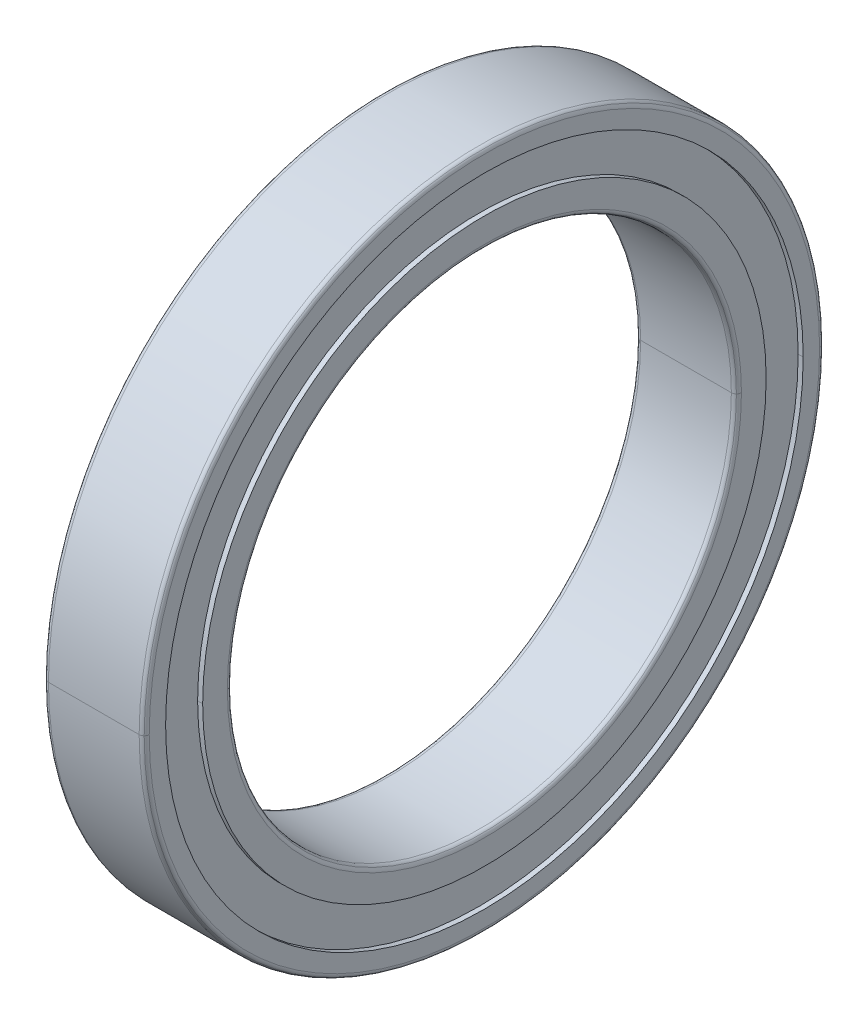
ISO-10303-21;
HEADER;
FILE_DESCRIPTION(('STEP AP214'),'2;1');
FILE_NAME('part.step','',(''),(''),'','','');
FILE_SCHEMA(('AUTOMOTIVE_DESIGN { 1 0 10303 214 1 1 1 1 }'));
ENDSEC;
DATA;
#1=APPLICATION_CONTEXT('core data for automotive mechanical design processes');
#2=APPLICATION_PROTOCOL_DEFINITION('international standard','automotive_design',2000,#1);
#3=PRODUCT_CONTEXT('',#1,'mechanical');
#4=PRODUCT('Part','Part','',(#3));
#5=PRODUCT_RELATED_PRODUCT_CATEGORY('part','',(#4));
#6=PRODUCT_DEFINITION_FORMATION('','',#4);
#7=PRODUCT_DEFINITION_CONTEXT('part definition',#1,'design');
#8=PRODUCT_DEFINITION('design','',#6,#7);
#9=PRODUCT_DEFINITION_SHAPE('','',#8);
#10=(LENGTH_UNIT() NAMED_UNIT(*) SI_UNIT(.MILLI.,.METRE.));
#11=(NAMED_UNIT(*) PLANE_ANGLE_UNIT() SI_UNIT($,.RADIAN.));
#12=(NAMED_UNIT(*) SI_UNIT($,.STERADIAN.) SOLID_ANGLE_UNIT());
#13=UNCERTAINTY_MEASURE_WITH_UNIT(LENGTH_MEASURE(1.E-05),#10,'distance_accuracy_value','');
#14=(GEOMETRIC_REPRESENTATION_CONTEXT(3) GLOBAL_UNCERTAINTY_ASSIGNED_CONTEXT((#13)) GLOBAL_UNIT_ASSIGNED_CONTEXT((#10,
#11,#12)) REPRESENTATION_CONTEXT('',''));
#15=CARTESIAN_POINT('',(0.,0.,0.));
#16=DIRECTION('',(0.,0.,1.));
#17=DIRECTION('',(1.,0.,0.));
#18=AXIS2_PLACEMENT_3D('',#15,#16,#17);
#19=CARTESIAN_POINT('',(3.8,0.,0.));
#20=DIRECTION('',(1.,0.,0.));
#21=DIRECTION('',(0.,0.,-1.));
#22=AXIS2_PLACEMENT_3D('',#19,#20,#21);
#23=TOROIDAL_SURFACE('',#22,10.2,0.2);
#24=CARTESIAN_POINT('',(3.8,0.,-10.2));
#25=DIRECTION('',(0.,-1.,0.));
#26=DIRECTION('',(1.,0.,0.));
#27=AXIS2_PLACEMENT_3D('',#24,#25,#26);
#28=CIRCLE('',#27,0.2);
#29=CARTESIAN_POINT('',(4.,0.,-10.2));
#30=VERTEX_POINT('',#29);
#31=CARTESIAN_POINT('',(3.941421356237,0.,-10.05857864376));
#32=VERTEX_POINT('',#31);
#33=EDGE_CURVE('E11',#30,#32,#28,.T.);
#34=ORIENTED_EDGE('',*,*,#33,.T.);
#35=CARTESIAN_POINT('',(3.941421356237,0.,0.));
#36=DIRECTION('',(1.,0.,0.));
#37=DIRECTION('',(0.,0.,1.));
#38=AXIS2_PLACEMENT_3D('',#35,#36,#37);
#39=CIRCLE('',#38,10.05857864376);
#40=CARTESIAN_POINT('',(3.941421356237,0.,10.05857864376));
#41=VERTEX_POINT('',#40);
#42=EDGE_CURVE('E43',#41,#32,#39,.T.);
#43=ORIENTED_EDGE('',*,*,#42,.F.);
#44=CARTESIAN_POINT('',(3.8,0.,10.2));
#45=DIRECTION('',(0.,1.,0.));
#46=DIRECTION('',(1.,0.,0.));
#47=AXIS2_PLACEMENT_3D('',#44,#45,#46);
#48=CIRCLE('',#47,0.2);
#49=CARTESIAN_POINT('',(4.,0.,10.2));
#50=VERTEX_POINT('',#49);
#51=EDGE_CURVE('E260',#50,#41,#48,.T.);
#52=ORIENTED_EDGE('',*,*,#51,.F.);
#53=CARTESIAN_POINT('',(4.,0.,0.));
#54=DIRECTION('',(-1.,0.,0.));
#55=DIRECTION('',(0.,0.,-1.));
#56=AXIS2_PLACEMENT_3D('',#53,#54,#55);
#57=CIRCLE('',#56,10.2);
#58=EDGE_CURVE('E255',#30,#50,#57,.T.);
#59=ORIENTED_EDGE('',*,*,#58,.F.);
#60=EDGE_LOOP('',(#34,#43,#52,#59));
#61=FACE_BOUND('',#60,.T.);
#62=ADVANCED_FACE('F17',(#61),#23,.T.);
#63=CARTESIAN_POINT('',(4.,0.,0.));
#64=DIRECTION('',(1.,0.,0.));
#65=DIRECTION('',(0.,0.,-1.));
#66=AXIS2_PLACEMENT_3D('',#63,#64,#65);
#67=CYLINDRICAL_SURFACE('',#66,11.18);
#68=DIRECTION('',(1.,0.,0.));
#69=VECTOR('',#68,1.);
#70=CARTESIAN_POINT('',(3.8,0.,-11.18));
#71=LINE('',#70,#69);
#72=CARTESIAN_POINT('',(3.8,0.,-11.18));
#73=VERTEX_POINT('',#72);
#74=CARTESIAN_POINT('',(4.,0.,-11.18));
#75=VERTEX_POINT('',#74);
#76=EDGE_CURVE('E28',#73,#75,#71,.T.);
#77=ORIENTED_EDGE('',*,*,#76,.T.);
#78=CARTESIAN_POINT('',(4.,0.,0.));
#79=DIRECTION('',(1.,0.,0.));
#80=DIRECTION('',(0.,0.,1.));
#81=AXIS2_PLACEMENT_3D('',#78,#79,#80);
#82=CIRCLE('',#81,11.18);
#83=CARTESIAN_POINT('',(4.,0.,11.18));
#84=VERTEX_POINT('',#83);
#85=EDGE_CURVE('E402',#84,#75,#82,.T.);
#86=ORIENTED_EDGE('',*,*,#85,.F.);
#87=DIRECTION('',(1.,0.,0.));
#88=VECTOR('',#87,1.);
#89=CARTESIAN_POINT('',(3.8,0.,11.18));
#90=LINE('',#89,#88);
#91=CARTESIAN_POINT('',(3.8,0.,11.18));
#92=VERTEX_POINT('',#91);
#93=EDGE_CURVE('E323',#92,#84,#90,.T.);
#94=ORIENTED_EDGE('',*,*,#93,.F.);
#95=CARTESIAN_POINT('',(3.8,0.,0.));
#96=DIRECTION('',(-1.,0.,0.));
#97=DIRECTION('',(0.,0.,-1.));
#98=AXIS2_PLACEMENT_3D('',#95,#96,#97);
#99=CIRCLE('',#98,11.18);
#100=EDGE_CURVE('E304',#73,#92,#99,.T.);
#101=ORIENTED_EDGE('',*,*,#100,.F.);
#102=EDGE_LOOP('',(#77,#86,#94,#101));
#103=FACE_BOUND('',#102,.T.);
#104=ADVANCED_FACE('F499',(#103),#67,.T.);
#105=CARTESIAN_POINT('',(4.,0.,0.));
#106=DIRECTION('',(1.,0.,0.));
#107=DIRECTION('',(0.,0.,-1.));
#108=AXIS2_PLACEMENT_3D('',#105,#106,#107);
#109=CYLINDRICAL_SURFACE('',#108,12.65);
#110=DIRECTION('',(1.,0.,0.));
#111=VECTOR('',#110,1.);
#112=CARTESIAN_POINT('',(3.8,0.,-12.65));
#113=LINE('',#112,#111);
#114=CARTESIAN_POINT('',(3.8,0.,-12.65));
#115=VERTEX_POINT('',#114);
#116=CARTESIAN_POINT('',(4.,0.,-12.65));
#117=VERTEX_POINT('',#116);
#118=EDGE_CURVE('E264',#115,#117,#113,.T.);
#119=ORIENTED_EDGE('',*,*,#118,.F.);
#120=CARTESIAN_POINT('',(3.8,0.,0.));
#121=DIRECTION('',(1.,0.,0.));
#122=DIRECTION('',(0.,0.,1.));
#123=AXIS2_PLACEMENT_3D('',#120,#121,#122);
#124=CIRCLE('',#123,12.65);
#125=CARTESIAN_POINT('',(3.8,0.,12.65));
#126=VERTEX_POINT('',#125);
#127=EDGE_CURVE('E261',#126,#115,#124,.T.);
#128=ORIENTED_EDGE('',*,*,#127,.F.);
#129=DIRECTION('',(1.,0.,0.));
#130=VECTOR('',#129,1.);
#131=CARTESIAN_POINT('',(3.8,0.,12.65));
#132=LINE('',#131,#130);
#133=CARTESIAN_POINT('',(4.,0.,12.65));
#134=VERTEX_POINT('',#133);
#135=EDGE_CURVE('E414',#126,#134,#132,.T.);
#136=ORIENTED_EDGE('',*,*,#135,.T.);
#137=CARTESIAN_POINT('',(4.,0.,0.));
#138=DIRECTION('',(-1.,0.,0.));
#139=DIRECTION('',(0.,0.,-1.));
#140=AXIS2_PLACEMENT_3D('',#137,#138,#139);
#141=CIRCLE('',#140,12.65);
#142=EDGE_CURVE('E288',#117,#134,#141,.T.);
#143=ORIENTED_EDGE('',*,*,#142,.F.);
#144=EDGE_LOOP('',(#119,#128,#136,#143));
#145=FACE_BOUND('',#144,.T.);
#146=ADVANCED_FACE('F506',(#145),#109,.F.);
#147=CARTESIAN_POINT('',(0.2,0.,0.));
#148=DIRECTION('',(1.,0.,0.));
#149=DIRECTION('',(0.,0.,-1.));
#150=AXIS2_PLACEMENT_3D('',#147,#148,#149);
#151=TOROIDAL_SURFACE('',#150,13.3,0.2);
#152=CARTESIAN_POINT('',(0.2,0.,-13.3));
#153=DIRECTION('',(0.,-1.,0.));
#154=DIRECTION('',(-1.,0.,0.));
#155=AXIS2_PLACEMENT_3D('',#152,#153,#154);
#156=CIRCLE('',#155,0.2);
#157=CARTESIAN_POINT('',(0.,0.,-13.3));
#158=VERTEX_POINT('',#157);
#159=CARTESIAN_POINT('',(0.05857864376269,0.,-13.44142135624));
#160=VERTEX_POINT('',#159);
#161=EDGE_CURVE('E417',#158,#160,#156,.T.);
#162=ORIENTED_EDGE('',*,*,#161,.T.);
#163=CARTESIAN_POINT('',(0.05857864376269,0.,0.));
#164=DIRECTION('',(1.,0.,0.));
#165=DIRECTION('',(0.,0.,1.));
#166=AXIS2_PLACEMENT_3D('',#163,#164,#165);
#167=CIRCLE('',#166,13.44142135624);
#168=CARTESIAN_POINT('',(0.05857864376269,0.,13.44142135624));
#169=VERTEX_POINT('',#168);
#170=EDGE_CURVE('E314',#169,#160,#167,.T.);
#171=ORIENTED_EDGE('',*,*,#170,.F.);
#172=CARTESIAN_POINT('',(0.2,0.,13.3));
#173=DIRECTION('',(0.,1.,0.));
#174=DIRECTION('',(-1.,0.,0.));
#175=AXIS2_PLACEMENT_3D('',#172,#173,#174);
#176=CIRCLE('',#175,0.2);
#177=CARTESIAN_POINT('',(0.,0.,13.3));
#178=VERTEX_POINT('',#177);
#179=EDGE_CURVE('E167',#178,#169,#176,.T.);
#180=ORIENTED_EDGE('',*,*,#179,.F.);
#181=CARTESIAN_POINT('',(0.,0.,0.));
#182=DIRECTION('',(-1.,0.,0.));
#183=DIRECTION('',(0.,0.,-1.));
#184=AXIS2_PLACEMENT_3D('',#181,#182,#183);
#185=CIRCLE('',#184,13.3);
#186=EDGE_CURVE('E174',#158,#178,#185,.T.);
#187=ORIENTED_EDGE('',*,*,#186,.F.);
#188=EDGE_LOOP('',(#162,#171,#180,#187));
#189=FACE_BOUND('',#188,.T.);
#190=ADVANCED_FACE('F544',(#189),#151,.T.);
#191=CARTESIAN_POINT('',(4.,0.,0.));
#192=DIRECTION('',(1.,0.,0.));
#193=DIRECTION('',(0.,0.,-1.));
#194=AXIS2_PLACEMENT_3D('',#191,#192,#193);
#195=CYLINDRICAL_SURFACE('',#194,12.65);
#196=DIRECTION('',(1.,0.,0.));
#197=VECTOR('',#196,1.);
#198=CARTESIAN_POINT('',(0.,0.,-12.65));
#199=LINE('',#198,#197);
#200=CARTESIAN_POINT('',(0.,0.,-12.65));
#201=VERTEX_POINT('',#200);
#202=CARTESIAN_POINT('',(0.2,0.,-12.65));
#203=VERTEX_POINT('',#202);
#204=EDGE_CURVE('E208',#201,#203,#199,.T.);
#205=ORIENTED_EDGE('',*,*,#204,.F.);
#206=CARTESIAN_POINT('',(0.,0.,0.));
#207=DIRECTION('',(1.,0.,0.));
#208=DIRECTION('',(0.,0.,1.));
#209=AXIS2_PLACEMENT_3D('',#206,#207,#208);
#210=CIRCLE('',#209,12.65);
#211=CARTESIAN_POINT('',(0.,0.,12.65));
#212=VERTEX_POINT('',#211);
#213=EDGE_CURVE('E278',#212,#201,#210,.T.);
#214=ORIENTED_EDGE('',*,*,#213,.F.);
#215=DIRECTION('',(1.,0.,0.));
#216=VECTOR('',#215,1.);
#217=CARTESIAN_POINT('',(0.,0.,12.65));
#218=LINE('',#217,#216);
#219=CARTESIAN_POINT('',(0.2,0.,12.65));
#220=VERTEX_POINT('',#219);
#221=EDGE_CURVE('E224',#212,#220,#218,.T.);
#222=ORIENTED_EDGE('',*,*,#221,.T.);
#223=CARTESIAN_POINT('',(0.2,0.,0.));
#224=DIRECTION('',(-1.,0.,0.));
#225=DIRECTION('',(0.,0.,-1.));
#226=AXIS2_PLACEMENT_3D('',#223,#224,#225);
#227=CIRCLE('',#226,12.65);
#228=EDGE_CURVE('E222',#203,#220,#227,.T.);
#229=ORIENTED_EDGE('',*,*,#228,.F.);
#230=EDGE_LOOP('',(#205,#214,#222,#229));
#231=FACE_BOUND('',#230,.T.);
#232=ADVANCED_FACE('F223',(#231),#195,.F.);
#233=CARTESIAN_POINT('',(4.,0.,0.));
#234=DIRECTION('',(1.,0.,0.));
#235=DIRECTION('',(0.,0.,-1.));
#236=AXIS2_PLACEMENT_3D('',#233,#234,#235);
#237=CYLINDRICAL_SURFACE('',#236,11.18);
#238=DIRECTION('',(1.,0.,0.));
#239=VECTOR('',#238,1.);
#240=CARTESIAN_POINT('',(0.,0.,-11.18));
#241=LINE('',#240,#239);
#242=CARTESIAN_POINT('',(0.,0.,-11.18));
#243=VERTEX_POINT('',#242);
#244=CARTESIAN_POINT('',(0.2,0.,-11.18));
#245=VERTEX_POINT('',#244);
#246=EDGE_CURVE('E240',#243,#245,#241,.T.);
#247=ORIENTED_EDGE('',*,*,#246,.T.);
#248=CARTESIAN_POINT('',(0.2,0.,0.));
#249=DIRECTION('',(1.,0.,0.));
#250=DIRECTION('',(0.,0.,1.));
#251=AXIS2_PLACEMENT_3D('',#248,#249,#250);
#252=CIRCLE('',#251,11.18);
#253=CARTESIAN_POINT('',(0.2,0.,11.18));
#254=VERTEX_POINT('',#253);
#255=EDGE_CURVE('E227',#254,#245,#252,.T.);
#256=ORIENTED_EDGE('',*,*,#255,.F.);
#257=DIRECTION('',(1.,0.,0.));
#258=VECTOR('',#257,1.);
#259=CARTESIAN_POINT('',(0.,0.,11.18));
#260=LINE('',#259,#258);
#261=CARTESIAN_POINT('',(0.,0.,11.18));
#262=VERTEX_POINT('',#261);
#263=EDGE_CURVE('E232',#262,#254,#260,.T.);
#264=ORIENTED_EDGE('',*,*,#263,.F.);
#265=CARTESIAN_POINT('',(0.,0.,0.));
#266=DIRECTION('',(-1.,0.,0.));
#267=DIRECTION('',(0.,0.,-1.));
#268=AXIS2_PLACEMENT_3D('',#265,#266,#267);
#269=CIRCLE('',#268,11.18);
#270=EDGE_CURVE('E272',#243,#262,#269,.T.);
#271=ORIENTED_EDGE('',*,*,#270,.F.);
#272=EDGE_LOOP('',(#247,#256,#264,#271));
#273=FACE_BOUND('',#272,.T.);
#274=ADVANCED_FACE('F543',(#273),#237,.T.);
#275=CARTESIAN_POINT('',(4.,0.,0.));
#276=DIRECTION('',(1.,0.,0.));
#277=DIRECTION('',(0.,0.,-1.));
#278=AXIS2_PLACEMENT_3D('',#275,#276,#277);
#279=CYLINDRICAL_SURFACE('',#278,11.18);
#280=ORIENTED_EDGE('',*,*,#263,.T.);
#281=CARTESIAN_POINT('',(0.2,0.,0.));
#282=DIRECTION('',(1.,0.,0.));
#283=DIRECTION('',(0.,0.,-1.));
#284=AXIS2_PLACEMENT_3D('',#281,#282,#283);
#285=CIRCLE('',#284,11.18);
#286=EDGE_CURVE('E218',#245,#254,#285,.T.);
#287=ORIENTED_EDGE('',*,*,#286,.F.);
#288=ORIENTED_EDGE('',*,*,#246,.F.);
#289=CARTESIAN_POINT('',(0.,0.,0.));
#290=DIRECTION('',(-1.,0.,0.));
#291=DIRECTION('',(0.,0.,1.));
#292=AXIS2_PLACEMENT_3D('',#289,#290,#291);
#293=CIRCLE('',#292,11.18);
#294=EDGE_CURVE('E254',#262,#243,#293,.T.);
#295=ORIENTED_EDGE('',*,*,#294,.F.);
#296=EDGE_LOOP('',(#280,#287,#288,#295));
#297=FACE_BOUND('',#296,.T.);
#298=ADVANCED_FACE('F569',(#297),#279,.T.);
#299=CARTESIAN_POINT('',(0.2,12.65,0.));
#300=DIRECTION('',(-1.,0.,0.));
#301=DIRECTION('',(0.,0.,1.));
#302=AXIS2_PLACEMENT_3D('',#299,#300,#301);
#303=PLANE('',#302);
#304=CARTESIAN_POINT('',(0.2,0.,0.));
#305=DIRECTION('',(-1.,0.,0.));
#306=DIRECTION('',(0.,0.,1.));
#307=AXIS2_PLACEMENT_3D('',#304,#305,#306);
#308=CIRCLE('',#307,12.65);
#309=EDGE_CURVE('E213',#220,#203,#308,.T.);
#310=ORIENTED_EDGE('',*,*,#309,.T.);
#311=ORIENTED_EDGE('',*,*,#228,.T.);
#312=EDGE_LOOP('',(#310,#311));
#313=FACE_BOUND('',#312,.T.);
#314=ORIENTED_EDGE('',*,*,#255,.T.);
#315=ORIENTED_EDGE('',*,*,#286,.T.);
#316=EDGE_LOOP('',(#314,#315));
#317=FACE_BOUND('',#316,.T.);
#318=ADVANCED_FACE('F229',(#313,#317),#303,.T.);
#319=CARTESIAN_POINT('',(4.,0.,0.));
#320=DIRECTION('',(1.,0.,0.));
#321=DIRECTION('',(0.,0.,-1.));
#322=AXIS2_PLACEMENT_3D('',#319,#320,#321);
#323=CYLINDRICAL_SURFACE('',#322,12.65);
#324=ORIENTED_EDGE('',*,*,#221,.F.);
#325=CARTESIAN_POINT('',(0.,0.,0.));
#326=DIRECTION('',(1.,0.,0.));
#327=DIRECTION('',(0.,0.,-1.));
#328=AXIS2_PLACEMENT_3D('',#325,#326,#327);
#329=CIRCLE('',#328,12.65);
#330=EDGE_CURVE('E215',#201,#212,#329,.T.);
#331=ORIENTED_EDGE('',*,*,#330,.F.);
#332=ORIENTED_EDGE('',*,*,#204,.T.);
#333=ORIENTED_EDGE('',*,*,#309,.F.);
#334=EDGE_LOOP('',(#324,#331,#332,#333));
#335=FACE_BOUND('',#334,.T.);
#336=ADVANCED_FACE('F211',(#335),#323,.F.);
#337=CARTESIAN_POINT('',(0.,13.3,0.));
#338=DIRECTION('',(-1.,0.,0.));
#339=DIRECTION('',(0.,0.,1.));
#340=AXIS2_PLACEMENT_3D('',#337,#338,#339);
#341=PLANE('',#340);
#342=CARTESIAN_POINT('',(0.,0.,0.));
#343=DIRECTION('',(-1.,0.,0.));
#344=DIRECTION('',(0.,0.,1.));
#345=AXIS2_PLACEMENT_3D('',#342,#343,#344);
#346=CIRCLE('',#345,13.3);
#347=EDGE_CURVE('E219',#178,#158,#346,.T.);
#348=ORIENTED_EDGE('',*,*,#347,.T.);
#349=ORIENTED_EDGE('',*,*,#186,.T.);
#350=EDGE_LOOP('',(#348,#349));
#351=FACE_BOUND('',#350,.T.);
#352=ORIENTED_EDGE('',*,*,#213,.T.);
#353=ORIENTED_EDGE('',*,*,#330,.T.);
#354=EDGE_LOOP('',(#352,#353));
#355=FACE_BOUND('',#354,.T.);
#356=ADVANCED_FACE('F425',(#351,#355),#341,.T.);
#357=CARTESIAN_POINT('',(0.2,0.,0.));
#358=DIRECTION('',(1.,0.,0.));
#359=DIRECTION('',(0.,0.,-1.));
#360=AXIS2_PLACEMENT_3D('',#357,#358,#359);
#361=TOROIDAL_SURFACE('',#360,13.3,0.2);
#362=ORIENTED_EDGE('',*,*,#179,.T.);
#363=CARTESIAN_POINT('',(0.05857864376269,0.,0.));
#364=DIRECTION('',(1.,0.,0.));
#365=DIRECTION('',(0.,0.,-1.));
#366=AXIS2_PLACEMENT_3D('',#363,#364,#365);
#367=CIRCLE('',#366,13.44142135624);
#368=EDGE_CURVE('E377',#160,#169,#367,.T.);
#369=ORIENTED_EDGE('',*,*,#368,.F.);
#370=ORIENTED_EDGE('',*,*,#161,.F.);
#371=ORIENTED_EDGE('',*,*,#347,.F.);
#372=EDGE_LOOP('',(#362,#369,#370,#371));
#373=FACE_BOUND('',#372,.T.);
#374=ADVANCED_FACE('F428',(#373),#361,.T.);
#375=CARTESIAN_POINT('',(3.8,0.,0.));
#376=DIRECTION('',(1.,0.,0.));
#377=DIRECTION('',(0.,0.,-1.));
#378=AXIS2_PLACEMENT_3D('',#375,#376,#377);
#379=TOROIDAL_SURFACE('',#378,13.3,0.2);
#380=CARTESIAN_POINT('',(3.8,0.,13.3));
#381=DIRECTION('',(0.,1.,0.));
#382=DIRECTION('',(0.,0.,1.));
#383=AXIS2_PLACEMENT_3D('',#380,#381,#382);
#384=CIRCLE('',#383,0.2);
#385=CARTESIAN_POINT('',(3.8,0.,13.5));
#386=VERTEX_POINT('',#385);
#387=CARTESIAN_POINT('',(3.941421356237,0.,13.44142135624));
#388=VERTEX_POINT('',#387);
#389=EDGE_CURVE('E281',#386,#388,#384,.T.);
#390=ORIENTED_EDGE('',*,*,#389,.T.);
#391=CARTESIAN_POINT('',(3.941421356237,0.,0.));
#392=DIRECTION('',(1.,0.,0.));
#393=DIRECTION('',(0.,0.,-1.));
#394=AXIS2_PLACEMENT_3D('',#391,#392,#393);
#395=CIRCLE('',#394,13.44142135624);
#396=CARTESIAN_POINT('',(3.941421356237,0.,-13.44142135624));
#397=VERTEX_POINT('',#396);
#398=EDGE_CURVE('E292',#397,#388,#395,.T.);
#399=ORIENTED_EDGE('',*,*,#398,.F.);
#400=CARTESIAN_POINT('',(3.8,0.,-13.3));
#401=DIRECTION('',(0.,-1.,0.));
#402=DIRECTION('',(0.,0.,-1.));
#403=AXIS2_PLACEMENT_3D('',#400,#401,#402);
#404=CIRCLE('',#403,0.2);
#405=CARTESIAN_POINT('',(3.8,0.,-13.5));
#406=VERTEX_POINT('',#405);
#407=EDGE_CURVE('E270',#406,#397,#404,.T.);
#408=ORIENTED_EDGE('',*,*,#407,.F.);
#409=CARTESIAN_POINT('',(3.8,0.,0.));
#410=DIRECTION('',(1.,0.,0.));
#411=DIRECTION('',(0.,0.,-1.));
#412=AXIS2_PLACEMENT_3D('',#409,#410,#411);
#413=CIRCLE('',#412,13.5);
#414=EDGE_CURVE('E21',#406,#386,#413,.T.);
#415=ORIENTED_EDGE('',*,*,#414,.T.);
#416=EDGE_LOOP('',(#390,#399,#408,#415));
#417=FACE_BOUND('',#416,.T.);
#418=ADVANCED_FACE('F765',(#417),#379,.T.);
#419=CARTESIAN_POINT('',(4.,0.,0.));
#420=DIRECTION('',(1.,0.,0.));
#421=DIRECTION('',(0.,0.,-1.));
#422=AXIS2_PLACEMENT_3D('',#419,#420,#421);
#423=CYLINDRICAL_SURFACE('',#422,13.5);
#424=DIRECTION('',(1.,0.,0.));
#425=VECTOR('',#424,1.);
#426=CARTESIAN_POINT('',(0.2,0.,13.5));
#427=LINE('',#426,#425);
#428=CARTESIAN_POINT('',(0.2,0.,13.5));
#429=VERTEX_POINT('',#428);
#430=EDGE_CURVE('E374',#429,#386,#427,.T.);
#431=ORIENTED_EDGE('',*,*,#430,.T.);
#432=ORIENTED_EDGE('',*,*,#414,.F.);
#433=DIRECTION('',(1.,0.,0.));
#434=VECTOR('',#433,1.);
#435=CARTESIAN_POINT('',(0.2,0.,-13.5));
#436=LINE('',#435,#434);
#437=CARTESIAN_POINT('',(0.2,0.,-13.5));
#438=VERTEX_POINT('',#437);
#439=EDGE_CURVE('E341',#438,#406,#436,.T.);
#440=ORIENTED_EDGE('',*,*,#439,.F.);
#441=CARTESIAN_POINT('',(0.2,0.,0.));
#442=DIRECTION('',(-1.,0.,0.));
#443=DIRECTION('',(0.,0.,1.));
#444=AXIS2_PLACEMENT_3D('',#441,#442,#443);
#445=CIRCLE('',#444,13.5);
#446=EDGE_CURVE('E244',#429,#438,#445,.T.);
#447=ORIENTED_EDGE('',*,*,#446,.F.);
#448=EDGE_LOOP('',(#431,#432,#440,#447));
#449=FACE_BOUND('',#448,.T.);
#450=ADVANCED_FACE('F511',(#449),#423,.T.);
#451=CARTESIAN_POINT('',(0.2,0.,0.));
#452=DIRECTION('',(1.,0.,0.));
#453=DIRECTION('',(0.,0.,-1.));
#454=AXIS2_PLACEMENT_3D('',#451,#452,#453);
#455=TOROIDAL_SURFACE('',#454,13.3,0.2);
#456=CARTESIAN_POINT('',(0.2,0.,-13.3));
#457=DIRECTION('',(0.,-1.,0.));
#458=DIRECTION('',(-0.707106781186547,0.,-0.707106781186548));
#459=AXIS2_PLACEMENT_3D('',#456,#457,#458);
#460=CIRCLE('',#459,0.2);
#461=EDGE_CURVE('E310',#160,#438,#460,.T.);
#462=ORIENTED_EDGE('',*,*,#461,.F.);
#463=ORIENTED_EDGE('',*,*,#368,.T.);
#464=CARTESIAN_POINT('',(0.2,0.,13.3));
#465=DIRECTION('',(0.,1.,0.));
#466=DIRECTION('',(-0.707106781186547,0.,0.707106781186548));
#467=AXIS2_PLACEMENT_3D('',#464,#465,#466);
#468=CIRCLE('',#467,0.2);
#469=EDGE_CURVE('E392',#169,#429,#468,.T.);
#470=ORIENTED_EDGE('',*,*,#469,.T.);
#471=ORIENTED_EDGE('',*,*,#446,.T.);
#472=EDGE_LOOP('',(#462,#463,#470,#471));
#473=FACE_BOUND('',#472,.T.);
#474=ADVANCED_FACE('F556',(#473),#455,.T.);
#475=CARTESIAN_POINT('',(0.2,0.,0.));
#476=DIRECTION('',(1.,0.,0.));
#477=DIRECTION('',(0.,0.,-1.));
#478=AXIS2_PLACEMENT_3D('',#475,#476,#477);
#479=TOROIDAL_SURFACE('',#478,13.3,0.2);
#480=ORIENTED_EDGE('',*,*,#469,.F.);
#481=ORIENTED_EDGE('',*,*,#170,.T.);
#482=ORIENTED_EDGE('',*,*,#461,.T.);
#483=CARTESIAN_POINT('',(0.2,0.,0.));
#484=DIRECTION('',(-1.,0.,0.));
#485=DIRECTION('',(0.,0.,-1.));
#486=AXIS2_PLACEMENT_3D('',#483,#484,#485);
#487=CIRCLE('',#486,13.5);
#488=EDGE_CURVE('E315',#438,#429,#487,.T.);
#489=ORIENTED_EDGE('',*,*,#488,.T.);
#490=EDGE_LOOP('',(#480,#481,#482,#489));
#491=FACE_BOUND('',#490,.T.);
#492=ADVANCED_FACE('F517',(#491),#479,.T.);
#493=CARTESIAN_POINT('',(4.,0.,0.));
#494=DIRECTION('',(1.,0.,0.));
#495=DIRECTION('',(0.,0.,-1.));
#496=AXIS2_PLACEMENT_3D('',#493,#494,#495);
#497=CYLINDRICAL_SURFACE('',#496,13.5);
#498=ORIENTED_EDGE('',*,*,#439,.T.);
#499=CARTESIAN_POINT('',(3.8,0.,0.));
#500=DIRECTION('',(1.,0.,0.));
#501=DIRECTION('',(0.,0.,1.));
#502=AXIS2_PLACEMENT_3D('',#499,#500,#501);
#503=CIRCLE('',#502,13.5);
#504=EDGE_CURVE('E266',#386,#406,#503,.T.);
#505=ORIENTED_EDGE('',*,*,#504,.F.);
#506=ORIENTED_EDGE('',*,*,#430,.F.);
#507=ORIENTED_EDGE('',*,*,#488,.F.);
#508=EDGE_LOOP('',(#498,#505,#506,#507));
#509=FACE_BOUND('',#508,.T.);
#510=ADVANCED_FACE('F513',(#509),#497,.T.);
#511=CARTESIAN_POINT('',(3.8,0.,0.));
#512=DIRECTION('',(1.,0.,0.));
#513=DIRECTION('',(0.,0.,-1.));
#514=AXIS2_PLACEMENT_3D('',#511,#512,#513);
#515=TOROIDAL_SURFACE('',#514,13.3,0.2);
#516=ORIENTED_EDGE('',*,*,#407,.T.);
#517=CARTESIAN_POINT('',(3.941421356237,0.,0.));
#518=DIRECTION('',(1.,0.,0.));
#519=DIRECTION('',(0.,0.,1.));
#520=AXIS2_PLACEMENT_3D('',#517,#518,#519);
#521=CIRCLE('',#520,13.44142135624);
#522=EDGE_CURVE('E271',#388,#397,#521,.T.);
#523=ORIENTED_EDGE('',*,*,#522,.F.);
#524=ORIENTED_EDGE('',*,*,#389,.F.);
#525=ORIENTED_EDGE('',*,*,#504,.T.);
#526=EDGE_LOOP('',(#516,#523,#524,#525));
#527=FACE_BOUND('',#526,.T.);
#528=ADVANCED_FACE('F516',(#527),#515,.T.);
#529=CARTESIAN_POINT('',(3.8,0.,0.));
#530=DIRECTION('',(1.,0.,0.));
#531=DIRECTION('',(0.,0.,-1.));
#532=AXIS2_PLACEMENT_3D('',#529,#530,#531);
#533=TOROIDAL_SURFACE('',#532,13.3,0.2);
#534=CARTESIAN_POINT('',(3.8,0.,13.3));
#535=DIRECTION('',(0.,1.,0.));
#536=DIRECTION('',(0.707106781186547,0.,0.707106781186549));
#537=AXIS2_PLACEMENT_3D('',#534,#535,#536);
#538=CIRCLE('',#537,0.2);
#539=CARTESIAN_POINT('',(4.,0.,13.3));
#540=VERTEX_POINT('',#539);
#541=EDGE_CURVE('E297',#388,#540,#538,.T.);
#542=ORIENTED_EDGE('',*,*,#541,.F.);
#543=ORIENTED_EDGE('',*,*,#522,.T.);
#544=CARTESIAN_POINT('',(3.8,0.,-13.3));
#545=DIRECTION('',(0.,-1.,0.));
#546=DIRECTION('',(0.707106781186547,0.,-0.707106781186549));
#547=AXIS2_PLACEMENT_3D('',#544,#545,#546);
#548=CIRCLE('',#547,0.2);
#549=CARTESIAN_POINT('',(4.,0.,-13.3));
#550=VERTEX_POINT('',#549);
#551=EDGE_CURVE('E296',#397,#550,#548,.T.);
#552=ORIENTED_EDGE('',*,*,#551,.T.);
#553=CARTESIAN_POINT('',(4.,0.,0.));
#554=DIRECTION('',(1.,0.,0.));
#555=DIRECTION('',(0.,0.,1.));
#556=AXIS2_PLACEMENT_3D('',#553,#554,#555);
#557=CIRCLE('',#556,13.3);
#558=EDGE_CURVE('E356',#540,#550,#557,.T.);
#559=ORIENTED_EDGE('',*,*,#558,.F.);
#560=EDGE_LOOP('',(#542,#543,#552,#559));
#561=FACE_BOUND('',#560,.T.);
#562=ADVANCED_FACE('F534',(#561),#533,.T.);
#563=CARTESIAN_POINT('',(3.8,0.,0.));
#564=DIRECTION('',(1.,0.,0.));
#565=DIRECTION('',(0.,0.,-1.));
#566=AXIS2_PLACEMENT_3D('',#563,#564,#565);
#567=TOROIDAL_SURFACE('',#566,13.3,0.2);
#568=ORIENTED_EDGE('',*,*,#551,.F.);
#569=ORIENTED_EDGE('',*,*,#398,.T.);
#570=ORIENTED_EDGE('',*,*,#541,.T.);
#571=CARTESIAN_POINT('',(4.,0.,0.));
#572=DIRECTION('',(1.,0.,0.));
#573=DIRECTION('',(0.,0.,-1.));
#574=AXIS2_PLACEMENT_3D('',#571,#572,#573);
#575=CIRCLE('',#574,13.3);
#576=EDGE_CURVE('E352',#550,#540,#575,.T.);
#577=ORIENTED_EDGE('',*,*,#576,.F.);
#578=EDGE_LOOP('',(#568,#569,#570,#577));
#579=FACE_BOUND('',#578,.T.);
#580=ADVANCED_FACE('F530',(#579),#567,.T.);
#581=CARTESIAN_POINT('',(4.,12.65,0.));
#582=DIRECTION('',(1.,0.,0.));
#583=DIRECTION('',(0.,1.,0.));
#584=AXIS2_PLACEMENT_3D('',#581,#582,#583);
#585=PLANE('',#584);
#586=ORIENTED_EDGE('',*,*,#558,.T.);
#587=ORIENTED_EDGE('',*,*,#576,.T.);
#588=EDGE_LOOP('',(#586,#587));
#589=FACE_BOUND('',#588,.T.);
#590=CARTESIAN_POINT('',(4.,0.,0.));
#591=DIRECTION('',(-1.,0.,0.));
#592=DIRECTION('',(0.,0.,1.));
#593=AXIS2_PLACEMENT_3D('',#590,#591,#592);
#594=CIRCLE('',#593,12.65);
#595=EDGE_CURVE('E357',#134,#117,#594,.T.);
#596=ORIENTED_EDGE('',*,*,#595,.T.);
#597=ORIENTED_EDGE('',*,*,#142,.T.);
#598=EDGE_LOOP('',(#596,#597));
#599=FACE_BOUND('',#598,.T.);
#600=ADVANCED_FACE('F533',(#589,#599),#585,.T.);
#601=CARTESIAN_POINT('',(4.,0.,0.));
#602=DIRECTION('',(1.,0.,0.));
#603=DIRECTION('',(0.,0.,-1.));
#604=AXIS2_PLACEMENT_3D('',#601,#602,#603);
#605=CYLINDRICAL_SURFACE('',#604,12.65);
#606=ORIENTED_EDGE('',*,*,#135,.F.);
#607=CARTESIAN_POINT('',(3.8,0.,0.));
#608=DIRECTION('',(1.,0.,0.));
#609=DIRECTION('',(0.,0.,-1.));
#610=AXIS2_PLACEMENT_3D('',#607,#608,#609);
#611=CIRCLE('',#610,12.65);
#612=EDGE_CURVE('E265',#115,#126,#611,.T.);
#613=ORIENTED_EDGE('',*,*,#612,.F.);
#614=ORIENTED_EDGE('',*,*,#118,.T.);
#615=ORIENTED_EDGE('',*,*,#595,.F.);
#616=EDGE_LOOP('',(#606,#613,#614,#615));
#617=FACE_BOUND('',#616,.T.);
#618=ADVANCED_FACE('F536',(#617),#605,.F.);
#619=CARTESIAN_POINT('',(3.8,11.18,0.));
#620=DIRECTION('',(1.,0.,0.));
#621=DIRECTION('',(0.,1.,0.));
#622=AXIS2_PLACEMENT_3D('',#619,#620,#621);
#623=PLANE('',#622);
#624=ORIENTED_EDGE('',*,*,#127,.T.);
#625=ORIENTED_EDGE('',*,*,#612,.T.);
#626=EDGE_LOOP('',(#624,#625));
#627=FACE_BOUND('',#626,.T.);
#628=CARTESIAN_POINT('',(3.8,0.,0.));
#629=DIRECTION('',(-1.,0.,0.));
#630=DIRECTION('',(0.,0.,1.));
#631=AXIS2_PLACEMENT_3D('',#628,#629,#630);
#632=CIRCLE('',#631,11.18);
#633=EDGE_CURVE('E300',#92,#73,#632,.T.);
#634=ORIENTED_EDGE('',*,*,#633,.T.);
#635=ORIENTED_EDGE('',*,*,#100,.T.);
#636=EDGE_LOOP('',(#634,#635));
#637=FACE_BOUND('',#636,.T.);
#638=ADVANCED_FACE('F539',(#627,#637),#623,.T.);
#639=CARTESIAN_POINT('',(4.,0.,0.));
#640=DIRECTION('',(1.,0.,0.));
#641=DIRECTION('',(0.,0.,-1.));
#642=AXIS2_PLACEMENT_3D('',#639,#640,#641);
#643=CYLINDRICAL_SURFACE('',#642,11.18);
#644=ORIENTED_EDGE('',*,*,#93,.T.);
#645=CARTESIAN_POINT('',(4.,0.,0.));
#646=DIRECTION('',(1.,0.,0.));
#647=DIRECTION('',(0.,0.,-1.));
#648=AXIS2_PLACEMENT_3D('',#645,#646,#647);
#649=CIRCLE('',#648,11.18);
#650=EDGE_CURVE('E396',#75,#84,#649,.T.);
#651=ORIENTED_EDGE('',*,*,#650,.F.);
#652=ORIENTED_EDGE('',*,*,#76,.F.);
#653=ORIENTED_EDGE('',*,*,#633,.F.);
#654=EDGE_LOOP('',(#644,#651,#652,#653));
#655=FACE_BOUND('',#654,.T.);
#656=ADVANCED_FACE('F573',(#655),#643,.T.);
#657=CARTESIAN_POINT('',(4.,10.2,0.));
#658=DIRECTION('',(1.,0.,0.));
#659=DIRECTION('',(0.,1.,0.));
#660=AXIS2_PLACEMENT_3D('',#657,#658,#659);
#661=PLANE('',#660);
#662=ORIENTED_EDGE('',*,*,#85,.T.);
#663=ORIENTED_EDGE('',*,*,#650,.T.);
#664=EDGE_LOOP('',(#662,#663));
#665=FACE_BOUND('',#664,.T.);
#666=CARTESIAN_POINT('',(4.,0.,0.));
#667=DIRECTION('',(-1.,0.,0.));
#668=DIRECTION('',(0.,0.,1.));
#669=AXIS2_PLACEMENT_3D('',#666,#667,#668);
#670=CIRCLE('',#669,10.2);
#671=EDGE_CURVE('E259',#50,#30,#670,.T.);
#672=ORIENTED_EDGE('',*,*,#671,.T.);
#673=ORIENTED_EDGE('',*,*,#58,.T.);
#674=EDGE_LOOP('',(#672,#673));
#675=FACE_BOUND('',#674,.T.);
#676=ADVANCED_FACE('F576',(#665,#675),#661,.T.);
#677=CARTESIAN_POINT('',(3.8,0.,0.));
#678=DIRECTION('',(1.,0.,0.));
#679=DIRECTION('',(0.,0.,-1.));
#680=AXIS2_PLACEMENT_3D('',#677,#678,#679);
#681=TOROIDAL_SURFACE('',#680,10.2,0.2);
#682=ORIENTED_EDGE('',*,*,#51,.T.);
#683=CARTESIAN_POINT('',(3.941421356237,0.,0.));
#684=DIRECTION('',(1.,0.,0.));
#685=DIRECTION('',(0.,0.,-1.));
#686=AXIS2_PLACEMENT_3D('',#683,#684,#685);
#687=CIRCLE('',#686,10.05857864376);
#688=EDGE_CURVE('E328',#32,#41,#687,.T.);
#689=ORIENTED_EDGE('',*,*,#688,.F.);
#690=ORIENTED_EDGE('',*,*,#33,.F.);
#691=ORIENTED_EDGE('',*,*,#671,.F.);
#692=EDGE_LOOP('',(#682,#689,#690,#691));
#693=FACE_BOUND('',#692,.T.);
#694=ADVANCED_FACE('F19',(#693),#681,.T.);
#695=CARTESIAN_POINT('',(0.2,0.,0.));
#696=DIRECTION('',(1.,0.,0.));
#697=DIRECTION('',(0.,0.,-1.));
#698=AXIS2_PLACEMENT_3D('',#695,#696,#697);
#699=TOROIDAL_SURFACE('',#698,10.2,0.2);
#700=CARTESIAN_POINT('',(0.2,0.,10.2));
#701=DIRECTION('',(0.,1.,0.));
#702=DIRECTION('',(0.,0.,-1.));
#703=AXIS2_PLACEMENT_3D('',#700,#701,#702);
#704=CIRCLE('',#703,0.2);
#705=CARTESIAN_POINT('',(0.2,0.,10.));
#706=VERTEX_POINT('',#705);
#707=CARTESIAN_POINT('',(0.05857864376269,0.,10.05857864376));
#708=VERTEX_POINT('',#707);
#709=EDGE_CURVE('E348',#706,#708,#704,.T.);
#710=ORIENTED_EDGE('',*,*,#709,.T.);
#711=CARTESIAN_POINT('',(0.05857864376269,0.,0.));
#712=DIRECTION('',(1.,0.,0.));
#713=DIRECTION('',(0.,0.,-1.));
#714=AXIS2_PLACEMENT_3D('',#711,#712,#713);
#715=CIRCLE('',#714,10.05857864376);
#716=CARTESIAN_POINT('',(0.05857864376269,0.,-10.05857864376));
#717=VERTEX_POINT('',#716);
#718=EDGE_CURVE('E253',#717,#708,#715,.T.);
#719=ORIENTED_EDGE('',*,*,#718,.F.);
#720=CARTESIAN_POINT('',(0.2,0.,-10.2));
#721=DIRECTION('',(0.,-1.,0.));
#722=DIRECTION('',(0.,0.,1.));
#723=AXIS2_PLACEMENT_3D('',#720,#721,#722);
#724=CIRCLE('',#723,0.2);
#725=CARTESIAN_POINT('',(0.2,0.,-10.));
#726=VERTEX_POINT('',#725);
#727=EDGE_CURVE('E285',#726,#717,#724,.T.);
#728=ORIENTED_EDGE('',*,*,#727,.F.);
#729=CARTESIAN_POINT('',(0.2,0.,0.));
#730=DIRECTION('',(1.,0.,0.));
#731=DIRECTION('',(0.,0.,-1.));
#732=AXIS2_PLACEMENT_3D('',#729,#730,#731);
#733=CIRCLE('',#732,10.);
#734=EDGE_CURVE('E337',#726,#706,#733,.T.);
#735=ORIENTED_EDGE('',*,*,#734,.T.);
#736=EDGE_LOOP('',(#710,#719,#728,#735));
#737=FACE_BOUND('',#736,.T.);
#738=ADVANCED_FACE('F550',(#737),#699,.T.);
#739=CARTESIAN_POINT('',(4.,0.,0.));
#740=DIRECTION('',(1.,0.,0.));
#741=DIRECTION('',(0.,0.,-1.));
#742=AXIS2_PLACEMENT_3D('',#739,#740,#741);
#743=CYLINDRICAL_SURFACE('',#742,10.);
#744=DIRECTION('',(1.,0.,0.));
#745=VECTOR('',#744,1.);
#746=CARTESIAN_POINT('',(0.2,0.,10.));
#747=LINE('',#746,#745);
#748=CARTESIAN_POINT('',(3.8,0.,10.));
#749=VERTEX_POINT('',#748);
#750=EDGE_CURVE('E282',#706,#749,#747,.T.);
#751=ORIENTED_EDGE('',*,*,#750,.F.);
#752=ORIENTED_EDGE('',*,*,#734,.F.);
#753=DIRECTION('',(1.,0.,0.));
#754=VECTOR('',#753,1.);
#755=CARTESIAN_POINT('',(0.2,0.,-10.));
#756=LINE('',#755,#754);
#757=CARTESIAN_POINT('',(3.8,0.,-10.));
#758=VERTEX_POINT('',#757);
#759=EDGE_CURVE('E333',#726,#758,#756,.T.);
#760=ORIENTED_EDGE('',*,*,#759,.T.);
#761=CARTESIAN_POINT('',(3.8,0.,0.));
#762=DIRECTION('',(-1.,0.,0.));
#763=DIRECTION('',(0.,0.,1.));
#764=AXIS2_PLACEMENT_3D('',#761,#762,#763);
#765=CIRCLE('',#764,10.);
#766=EDGE_CURVE('E329',#749,#758,#765,.T.);
#767=ORIENTED_EDGE('',*,*,#766,.F.);
#768=EDGE_LOOP('',(#751,#752,#760,#767));
#769=FACE_BOUND('',#768,.T.);
#770=ADVANCED_FACE('F481',(#769),#743,.F.);
#771=CARTESIAN_POINT('',(3.8,0.,0.));
#772=DIRECTION('',(1.,0.,0.));
#773=DIRECTION('',(0.,0.,-1.));
#774=AXIS2_PLACEMENT_3D('',#771,#772,#773);
#775=TOROIDAL_SURFACE('',#774,10.2,0.2);
#776=CARTESIAN_POINT('',(3.8,0.,-10.2));
#777=DIRECTION('',(0.,-1.,0.));
#778=DIRECTION('',(0.707106781186497,0.,0.707106781186599));
#779=AXIS2_PLACEMENT_3D('',#776,#777,#778);
#780=CIRCLE('',#779,0.2);
#781=EDGE_CURVE('E246',#32,#758,#780,.T.);
#782=ORIENTED_EDGE('',*,*,#781,.F.);
#783=ORIENTED_EDGE('',*,*,#688,.T.);
#784=CARTESIAN_POINT('',(3.8,0.,10.2));
#785=DIRECTION('',(0.,1.,0.));
#786=DIRECTION('',(0.707106781186497,0.,-0.707106781186599));
#787=AXIS2_PLACEMENT_3D('',#784,#785,#786);
#788=CIRCLE('',#787,0.2);
#789=EDGE_CURVE('E324',#41,#749,#788,.T.);
#790=ORIENTED_EDGE('',*,*,#789,.T.);
#791=ORIENTED_EDGE('',*,*,#766,.T.);
#792=EDGE_LOOP('',(#782,#783,#790,#791));
#793=FACE_BOUND('',#792,.T.);
#794=ADVANCED_FACE('F476',(#793),#775,.T.);
#795=CARTESIAN_POINT('',(3.8,0.,0.));
#796=DIRECTION('',(1.,0.,0.));
#797=DIRECTION('',(0.,0.,-1.));
#798=AXIS2_PLACEMENT_3D('',#795,#796,#797);
#799=TOROIDAL_SURFACE('',#798,10.2,0.2);
#800=ORIENTED_EDGE('',*,*,#789,.F.);
#801=ORIENTED_EDGE('',*,*,#42,.T.);
#802=ORIENTED_EDGE('',*,*,#781,.T.);
#803=CARTESIAN_POINT('',(3.8,0.,0.));
#804=DIRECTION('',(-1.,0.,0.));
#805=DIRECTION('',(0.,0.,-1.));
#806=AXIS2_PLACEMENT_3D('',#803,#804,#805);
#807=CIRCLE('',#806,10.);
#808=EDGE_CURVE('E248',#758,#749,#807,.T.);
#809=ORIENTED_EDGE('',*,*,#808,.T.);
#810=EDGE_LOOP('',(#800,#801,#802,#809));
#811=FACE_BOUND('',#810,.T.);
#812=ADVANCED_FACE('F485',(#811),#799,.T.);
#813=CARTESIAN_POINT('',(4.,0.,0.));
#814=DIRECTION('',(1.,0.,0.));
#815=DIRECTION('',(0.,0.,-1.));
#816=AXIS2_PLACEMENT_3D('',#813,#814,#815);
#817=CYLINDRICAL_SURFACE('',#816,10.);
#818=ORIENTED_EDGE('',*,*,#759,.F.);
#819=CARTESIAN_POINT('',(0.2,0.,0.));
#820=DIRECTION('',(1.,0.,0.));
#821=DIRECTION('',(0.,0.,1.));
#822=AXIS2_PLACEMENT_3D('',#819,#820,#821);
#823=CIRCLE('',#822,10.);
#824=EDGE_CURVE('E305',#706,#726,#823,.T.);
#825=ORIENTED_EDGE('',*,*,#824,.F.);
#826=ORIENTED_EDGE('',*,*,#750,.T.);
#827=ORIENTED_EDGE('',*,*,#808,.F.);
#828=EDGE_LOOP('',(#818,#825,#826,#827));
#829=FACE_BOUND('',#828,.T.);
#830=ADVANCED_FACE('F484',(#829),#817,.F.);
#831=CARTESIAN_POINT('',(0.2,0.,0.));
#832=DIRECTION('',(1.,0.,0.));
#833=DIRECTION('',(0.,0.,-1.));
#834=AXIS2_PLACEMENT_3D('',#831,#832,#833);
#835=TOROIDAL_SURFACE('',#834,10.2,0.2);
#836=ORIENTED_EDGE('',*,*,#727,.T.);
#837=CARTESIAN_POINT('',(0.05857864376269,0.,0.));
#838=DIRECTION('',(1.,0.,0.));
#839=DIRECTION('',(0.,0.,1.));
#840=AXIS2_PLACEMENT_3D('',#837,#838,#839);
#841=CIRCLE('',#840,10.05857864376);
#842=EDGE_CURVE('E309',#708,#717,#841,.T.);
#843=ORIENTED_EDGE('',*,*,#842,.F.);
#844=ORIENTED_EDGE('',*,*,#709,.F.);
#845=ORIENTED_EDGE('',*,*,#824,.T.);
#846=EDGE_LOOP('',(#836,#843,#844,#845));
#847=FACE_BOUND('',#846,.T.);
#848=ADVANCED_FACE('F494',(#847),#835,.T.);
#849=CARTESIAN_POINT('',(0.2,0.,0.));
#850=DIRECTION('',(1.,0.,0.));
#851=DIRECTION('',(0.,0.,-1.));
#852=AXIS2_PLACEMENT_3D('',#849,#850,#851);
#853=TOROIDAL_SURFACE('',#852,10.2,0.2);
#854=CARTESIAN_POINT('',(0.2,0.,10.2));
#855=DIRECTION('',(0.,1.,0.));
#856=DIRECTION('',(-0.707106781186496,0.,-0.707106781186599));
#857=AXIS2_PLACEMENT_3D('',#854,#855,#856);
#858=CIRCLE('',#857,0.2);
#859=CARTESIAN_POINT('',(0.,0.,10.2));
#860=VERTEX_POINT('',#859);
#861=EDGE_CURVE('E249',#708,#860,#858,.T.);
#862=ORIENTED_EDGE('',*,*,#861,.F.);
#863=ORIENTED_EDGE('',*,*,#842,.T.);
#864=CARTESIAN_POINT('',(0.2,0.,-10.2));
#865=DIRECTION('',(0.,-1.,0.));
#866=DIRECTION('',(-0.707106781186496,0.,0.707106781186599));
#867=AXIS2_PLACEMENT_3D('',#864,#865,#866);
#868=CIRCLE('',#867,0.2);
#869=CARTESIAN_POINT('',(0.,0.,-10.2));
#870=VERTEX_POINT('',#869);
#871=EDGE_CURVE('E319',#717,#870,#868,.T.);
#872=ORIENTED_EDGE('',*,*,#871,.T.);
#873=CARTESIAN_POINT('',(0.,0.,0.));
#874=DIRECTION('',(1.,0.,0.));
#875=DIRECTION('',(0.,0.,1.));
#876=AXIS2_PLACEMENT_3D('',#873,#874,#875);
#877=CIRCLE('',#876,10.2);
#878=EDGE_CURVE('E275',#860,#870,#877,.T.);
#879=ORIENTED_EDGE('',*,*,#878,.F.);
#880=EDGE_LOOP('',(#862,#863,#872,#879));
#881=FACE_BOUND('',#880,.T.);
#882=ADVANCED_FACE('F523',(#881),#853,.T.);
#883=CARTESIAN_POINT('',(0.2,0.,0.));
#884=DIRECTION('',(1.,0.,0.));
#885=DIRECTION('',(0.,0.,-1.));
#886=AXIS2_PLACEMENT_3D('',#883,#884,#885);
#887=TOROIDAL_SURFACE('',#886,10.2,0.2);
#888=ORIENTED_EDGE('',*,*,#871,.F.);
#889=ORIENTED_EDGE('',*,*,#718,.T.);
#890=ORIENTED_EDGE('',*,*,#861,.T.);
#891=CARTESIAN_POINT('',(0.,0.,0.));
#892=DIRECTION('',(1.,0.,0.));
#893=DIRECTION('',(0.,0.,-1.));
#894=AXIS2_PLACEMENT_3D('',#891,#892,#893);
#895=CIRCLE('',#894,10.2);
#896=EDGE_CURVE('E453',#870,#860,#895,.T.);
#897=ORIENTED_EDGE('',*,*,#896,.F.);
#898=EDGE_LOOP('',(#888,#889,#890,#897));
#899=FACE_BOUND('',#898,.T.);
#900=ADVANCED_FACE('F528',(#899),#887,.T.);
#901=CARTESIAN_POINT('',(0.,11.18,0.));
#902=DIRECTION('',(-1.,0.,0.));
#903=DIRECTION('',(0.,0.,1.));
#904=AXIS2_PLACEMENT_3D('',#901,#902,#903);
#905=PLANE('',#904);
#906=ORIENTED_EDGE('',*,*,#294,.T.);
#907=ORIENTED_EDGE('',*,*,#270,.T.);
#908=EDGE_LOOP('',(#906,#907));
#909=FACE_BOUND('',#908,.T.);
#910=ORIENTED_EDGE('',*,*,#878,.T.);
#911=ORIENTED_EDGE('',*,*,#896,.T.);
#912=EDGE_LOOP('',(#910,#911));
#913=FACE_BOUND('',#912,.T.);
#914=ADVANCED_FACE('F525',(#909,#913),#905,.T.);
#915=CLOSED_SHELL('',(#62,#104,#146,#190,#232,#274,#298,#318,#336,#356,#374,#418,#450,#474,#492,
#510,#528,#562,#580,#600,#618,#638,#656,#676,#694,#738,#770,#794,#812,#830,#848,#882,#900,#914));
#916=MANIFOLD_SOLID_BREP('B1',#915);
#917=ADVANCED_BREP_SHAPE_REPRESENTATION('',(#18,#916),#14);
#918=SHAPE_DEFINITION_REPRESENTATION(#9,#917);
ENDSEC;
END-ISO-10303-21;
